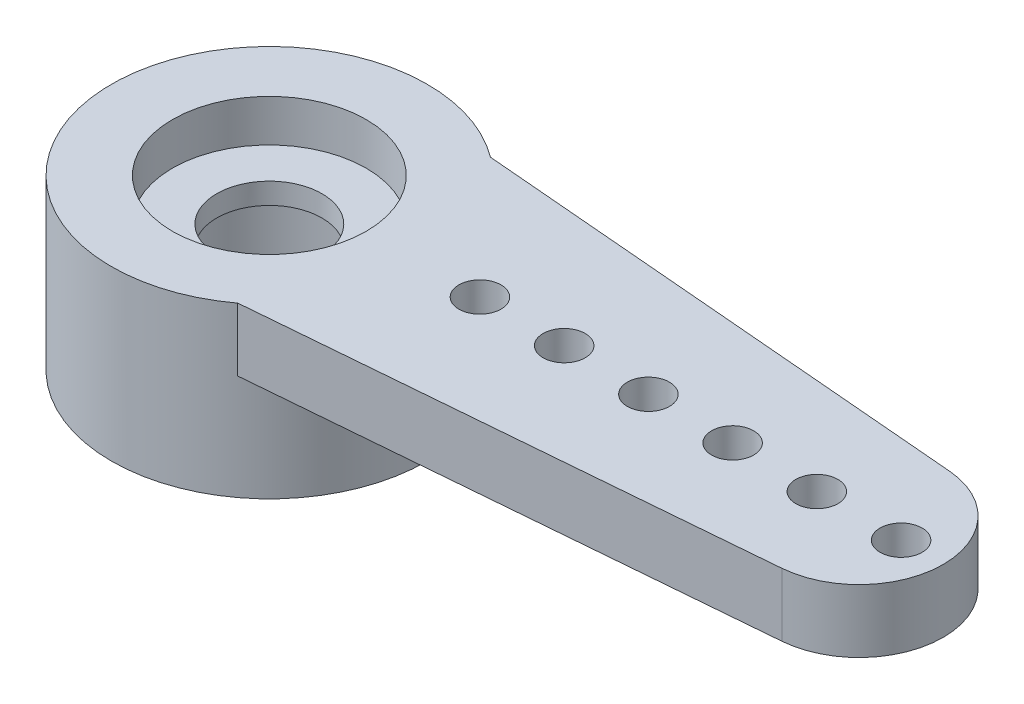
ISO-10303-21;
HEADER;
FILE_DESCRIPTION(('STEP AP214'),'2;1');
FILE_NAME('part.step','',(''),(''),'','','');
FILE_SCHEMA(('AUTOMOTIVE_DESIGN { 1 0 10303 214 1 1 1 1 }'));
ENDSEC;
DATA;
#1=APPLICATION_CONTEXT('core data for automotive mechanical design processes');
#2=APPLICATION_PROTOCOL_DEFINITION('international standard','automotive_design',2000,#1);
#3=PRODUCT_CONTEXT('',#1,'mechanical');
#4=PRODUCT('Part','Part','',(#3));
#5=PRODUCT_RELATED_PRODUCT_CATEGORY('part','',(#4));
#6=PRODUCT_DEFINITION_FORMATION('','',#4);
#7=PRODUCT_DEFINITION_CONTEXT('part definition',#1,'design');
#8=PRODUCT_DEFINITION('design','',#6,#7);
#9=PRODUCT_DEFINITION_SHAPE('','',#8);
#10=(LENGTH_UNIT() NAMED_UNIT(*) SI_UNIT(.MILLI.,.METRE.));
#11=(NAMED_UNIT(*) PLANE_ANGLE_UNIT() SI_UNIT($,.RADIAN.));
#12=(NAMED_UNIT(*) SI_UNIT($,.STERADIAN.) SOLID_ANGLE_UNIT());
#13=UNCERTAINTY_MEASURE_WITH_UNIT(LENGTH_MEASURE(1.E-05),#10,'distance_accuracy_value','');
#14=(GEOMETRIC_REPRESENTATION_CONTEXT(3) GLOBAL_UNCERTAINTY_ASSIGNED_CONTEXT((#13)) GLOBAL_UNIT_ASSIGNED_CONTEXT((#10,
#11,#12)) REPRESENTATION_CONTEXT('',''));
#15=CARTESIAN_POINT('',(0.,0.,0.));
#16=DIRECTION('',(0.,0.,1.));
#17=DIRECTION('',(1.,0.,0.));
#18=AXIS2_PLACEMENT_3D('',#15,#16,#17);
#19=CARTESIAN_POINT('',(0.,-1.5,0.));
#20=DIRECTION('',(0.,1.,0.));
#21=DIRECTION('',(0.,0.,1.));
#22=AXIS2_PLACEMENT_3D('',#19,#20,#21);
#23=CYLINDRICAL_SURFACE('',#22,1.25);
#24=CARTESIAN_POINT('',(0.,3.,0.));
#25=DIRECTION('',(0.,1.,0.));
#26=DIRECTION('',(0.,0.,1.));
#27=AXIS2_PLACEMENT_3D('',#24,#25,#26);
#28=CIRCLE('',#27,1.25);
#29=CARTESIAN_POINT('',(0.,3.,1.25));
#30=VERTEX_POINT('',#29);
#31=EDGE_CURVE('E189',#30,#30,#28,.T.);
#32=ORIENTED_EDGE('',*,*,#31,.T.);
#33=EDGE_LOOP('',(#32));
#34=FACE_BOUND('',#33,.T.);
#35=CARTESIAN_POINT('',(0.,2.5,0.));
#36=DIRECTION('',(0.,-1.,0.));
#37=DIRECTION('',(0.,0.,-1.));
#38=AXIS2_PLACEMENT_3D('',#35,#36,#37);
#39=CIRCLE('',#38,1.25);
#40=CARTESIAN_POINT('',(0.,2.5,-1.25));
#41=VERTEX_POINT('',#40);
#42=EDGE_CURVE('E37',#41,#41,#39,.F.);
#43=ORIENTED_EDGE('',*,*,#42,.F.);
#44=EDGE_LOOP('',(#43));
#45=FACE_BOUND('',#44,.T.);
#46=ADVANCED_FACE('F33',(#34,#45),#23,.F.);
#47=CARTESIAN_POINT('',(0.,4.,0.));
#48=DIRECTION('',(0.,-1.,0.));
#49=DIRECTION('',(0.,0.,-1.));
#50=AXIS2_PLACEMENT_3D('',#47,#48,#49);
#51=CYLINDRICAL_SURFACE('',#50,3.75);
#52=CARTESIAN_POINT('',(0.,4.,0.));
#53=DIRECTION('',(0.,1.,0.));
#54=DIRECTION('',(0.,0.,1.));
#55=AXIS2_PLACEMENT_3D('',#52,#53,#54);
#56=CIRCLE('',#55,3.75);
#57=CARTESIAN_POINT('',(2.25,4.,-3.));
#58=VERTEX_POINT('',#57);
#59=CARTESIAN_POINT('',(2.25,4.,3.));
#60=VERTEX_POINT('',#59);
#61=EDGE_CURVE('E11',#58,#60,#56,.T.);
#62=ORIENTED_EDGE('',*,*,#61,.F.);
#63=DIRECTION('',(0.,1.,0.));
#64=VECTOR('',#63,1.);
#65=CARTESIAN_POINT('',(2.25,2.5,-3.));
#66=LINE('',#65,#64);
#67=CARTESIAN_POINT('',(2.25,2.5,-3.));
#68=VERTEX_POINT('',#67);
#69=EDGE_CURVE('E106',#68,#58,#66,.T.);
#70=ORIENTED_EDGE('',*,*,#69,.F.);
#71=CARTESIAN_POINT('',(0.,2.5,0.));
#72=DIRECTION('',(0.,-1.,0.));
#73=DIRECTION('',(0.,0.,-1.));
#74=AXIS2_PLACEMENT_3D('',#71,#72,#73);
#75=CIRCLE('',#74,3.75);
#76=CARTESIAN_POINT('',(2.25,2.5,3.));
#77=VERTEX_POINT('',#76);
#78=EDGE_CURVE('E58',#68,#77,#75,.T.);
#79=ORIENTED_EDGE('',*,*,#78,.T.);
#80=DIRECTION('',(0.,1.,0.));
#81=VECTOR('',#80,1.);
#82=CARTESIAN_POINT('',(2.25,2.5,3.));
#83=LINE('',#82,#81);
#84=EDGE_CURVE('E82',#77,#60,#83,.T.);
#85=ORIENTED_EDGE('',*,*,#84,.T.);
#86=EDGE_LOOP('',(#62,#70,#79,#85));
#87=FACE_BOUND('',#86,.T.);
#88=CARTESIAN_POINT('',(0.,0.,0.));
#89=DIRECTION('',(0.,1.,0.));
#90=DIRECTION('',(0.,0.,1.));
#91=AXIS2_PLACEMENT_3D('',#88,#89,#90);
#92=CIRCLE('',#91,3.75);
#93=CARTESIAN_POINT('',(0.,0.,3.75));
#94=VERTEX_POINT('',#93);
#95=EDGE_CURVE('E42',#94,#94,#92,.T.);
#96=ORIENTED_EDGE('',*,*,#95,.T.);
#97=EDGE_LOOP('',(#96));
#98=FACE_BOUND('',#97,.T.);
#99=ADVANCED_FACE('F35',(#87,#98),#51,.T.);
#100=CARTESIAN_POINT('',(0.,4.,0.));
#101=DIRECTION('',(0.,1.,0.));
#102=DIRECTION('',(0.,0.,1.));
#103=AXIS2_PLACEMENT_3D('',#100,#101,#102);
#104=PLANE('',#103);
#105=CARTESIAN_POINT('',(0.,4.,0.));
#106=DIRECTION('',(0.,1.,0.));
#107=DIRECTION('',(0.,0.,1.));
#108=AXIS2_PLACEMENT_3D('',#105,#106,#107);
#109=CIRCLE('',#108,2.3);
#110=CARTESIAN_POINT('',(0.,4.,2.3));
#111=VERTEX_POINT('',#110);
#112=EDGE_CURVE('E108',#111,#111,#109,.T.);
#113=ORIENTED_EDGE('',*,*,#112,.F.);
#114=EDGE_LOOP('',(#113));
#115=FACE_BOUND('',#114,.T.);
#116=ORIENTED_EDGE('',*,*,#61,.T.);
#117=DIRECTION('',(0.996448898518601,0.,-0.0841997187707063));
#118=VECTOR('',#117,1.);
#119=CARTESIAN_POINT('',(14.1683994375414,4.,1.9928977970372));
#120=LINE('',#119,#118);
#121=CARTESIAN_POINT('',(14.1683994375414,4.,1.99289779703721));
#122=VERTEX_POINT('',#121);
#123=EDGE_CURVE('E101',#60,#122,#120,.T.);
#124=ORIENTED_EDGE('',*,*,#123,.T.);
#125=CARTESIAN_POINT('',(14.,4.,0.));
#126=DIRECTION('',(0.,1.,0.));
#127=DIRECTION('',(0.,0.,-1.));
#128=AXIS2_PLACEMENT_3D('',#125,#126,#127);
#129=CIRCLE('',#128,2.);
#130=CARTESIAN_POINT('',(14.1683994375414,4.,-1.9928977970372));
#131=VERTEX_POINT('',#130);
#132=EDGE_CURVE('E88',#122,#131,#129,.T.);
#133=ORIENTED_EDGE('',*,*,#132,.T.);
#134=DIRECTION('',(-0.996448898518601,0.,-0.0841997187707069));
#135=VECTOR('',#134,1.);
#136=CARTESIAN_POINT('',(14.1683994375414,4.,-1.9928977970372));
#137=LINE('',#136,#135);
#138=EDGE_CURVE('E49',#131,#58,#137,.T.);
#139=ORIENTED_EDGE('',*,*,#138,.T.);
#140=EDGE_LOOP('',(#116,#124,#133,#139));
#141=FACE_BOUND('',#140,.T.);
#142=CARTESIAN_POINT('',(13.,4.,0.));
#143=DIRECTION('',(0.,1.,0.));
#144=DIRECTION('',(0.,0.,-1.));
#145=AXIS2_PLACEMENT_3D('',#142,#143,#144);
#146=CIRCLE('',#145,0.500000000000001);
#147=CARTESIAN_POINT('',(13.,4.,-0.499999999999997));
#148=VERTEX_POINT('',#147);
#149=EDGE_CURVE('E198',#148,#148,#146,.T.);
#150=ORIENTED_EDGE('',*,*,#149,.F.);
#151=EDGE_LOOP('',(#150));
#152=FACE_BOUND('',#151,.T.);
#153=CARTESIAN_POINT('',(11.,4.,0.));
#154=DIRECTION('',(0.,1.,0.));
#155=DIRECTION('',(0.,0.,-1.));
#156=AXIS2_PLACEMENT_3D('',#153,#154,#155);
#157=CIRCLE('',#156,0.500000000000001);
#158=CARTESIAN_POINT('',(11.,4.,-0.499999999999997));
#159=VERTEX_POINT('',#158);
#160=EDGE_CURVE('E202',#159,#159,#157,.T.);
#161=ORIENTED_EDGE('',*,*,#160,.F.);
#162=EDGE_LOOP('',(#161));
#163=FACE_BOUND('',#162,.T.);
#164=CARTESIAN_POINT('',(9.,4.,0.));
#165=DIRECTION('',(0.,1.,0.));
#166=DIRECTION('',(0.,0.,-1.));
#167=AXIS2_PLACEMENT_3D('',#164,#165,#166);
#168=CIRCLE('',#167,0.500000000000001);
#169=CARTESIAN_POINT('',(9.,4.,-0.499999999999997));
#170=VERTEX_POINT('',#169);
#171=EDGE_CURVE('E206',#170,#170,#168,.T.);
#172=ORIENTED_EDGE('',*,*,#171,.F.);
#173=EDGE_LOOP('',(#172));
#174=FACE_BOUND('',#173,.T.);
#175=CARTESIAN_POINT('',(7.,4.,0.));
#176=DIRECTION('',(0.,1.,0.));
#177=DIRECTION('',(0.,0.,-1.));
#178=AXIS2_PLACEMENT_3D('',#175,#176,#177);
#179=CIRCLE('',#178,0.500000000000001);
#180=CARTESIAN_POINT('',(7.,4.,-0.499999999999997));
#181=VERTEX_POINT('',#180);
#182=EDGE_CURVE('E210',#181,#181,#179,.T.);
#183=ORIENTED_EDGE('',*,*,#182,.F.);
#184=EDGE_LOOP('',(#183));
#185=FACE_BOUND('',#184,.T.);
#186=CARTESIAN_POINT('',(5.,4.,0.));
#187=DIRECTION('',(0.,1.,0.));
#188=DIRECTION('',(0.,0.,-1.));
#189=AXIS2_PLACEMENT_3D('',#186,#187,#188);
#190=CIRCLE('',#189,0.500000000000001);
#191=CARTESIAN_POINT('',(5.,4.,-0.499999999999997));
#192=VERTEX_POINT('',#191);
#193=EDGE_CURVE('E214',#192,#192,#190,.T.);
#194=ORIENTED_EDGE('',*,*,#193,.F.);
#195=EDGE_LOOP('',(#194));
#196=FACE_BOUND('',#195,.T.);
#197=CARTESIAN_POINT('',(15.,4.,0.));
#198=DIRECTION('',(0.,1.,0.));
#199=DIRECTION('',(0.,0.,-1.));
#200=AXIS2_PLACEMENT_3D('',#197,#198,#199);
#201=CIRCLE('',#200,0.500000000000001);
#202=CARTESIAN_POINT('',(15.,4.,-0.499999999999997));
#203=VERTEX_POINT('',#202);
#204=EDGE_CURVE('E217',#203,#203,#201,.T.);
#205=ORIENTED_EDGE('',*,*,#204,.F.);
#206=EDGE_LOOP('',(#205));
#207=FACE_BOUND('',#206,.T.);
#208=ADVANCED_FACE('F122',(#115,#141,#152,#163,#174,#185,#196,#207),#104,.T.);
#209=CARTESIAN_POINT('',(0.,0.,0.));
#210=DIRECTION('',(0.,1.,0.));
#211=DIRECTION('',(0.,0.,1.));
#212=AXIS2_PLACEMENT_3D('',#209,#210,#211);
#213=PLANE('',#212);
#214=CARTESIAN_POINT('',(0.,0.,0.));
#215=DIRECTION('',(0.,-1.,0.));
#216=DIRECTION('',(0.,0.,-1.));
#217=AXIS2_PLACEMENT_3D('',#214,#215,#216);
#218=CIRCLE('',#217,2.3);
#219=CARTESIAN_POINT('',(0.,0.,-2.3));
#220=VERTEX_POINT('',#219);
#221=EDGE_CURVE('E243',#220,#220,#218,.T.);
#222=ORIENTED_EDGE('',*,*,#221,.F.);
#223=EDGE_LOOP('',(#222));
#224=FACE_BOUND('',#223,.T.);
#225=ORIENTED_EDGE('',*,*,#95,.F.);
#226=EDGE_LOOP('',(#225));
#227=FACE_BOUND('',#226,.T.);
#228=ADVANCED_FACE('F119',(#224,#227),#213,.F.);
#229=CARTESIAN_POINT('',(0.,3.,0.));
#230=DIRECTION('',(0.,1.,0.));
#231=DIRECTION('',(0.,0.,1.));
#232=AXIS2_PLACEMENT_3D('',#229,#230,#231);
#233=CYLINDRICAL_SURFACE('',#232,2.3);
#234=CARTESIAN_POINT('',(0.,3.,0.));
#235=DIRECTION('',(0.,1.,0.));
#236=DIRECTION('',(0.,0.,1.));
#237=AXIS2_PLACEMENT_3D('',#234,#235,#236);
#238=CIRCLE('',#237,2.3);
#239=CARTESIAN_POINT('',(0.,3.,2.3));
#240=VERTEX_POINT('',#239);
#241=EDGE_CURVE('E111',#240,#240,#238,.T.);
#242=ORIENTED_EDGE('',*,*,#241,.F.);
#243=EDGE_LOOP('',(#242));
#244=FACE_BOUND('',#243,.T.);
#245=ORIENTED_EDGE('',*,*,#112,.T.);
#246=EDGE_LOOP('',(#245));
#247=FACE_BOUND('',#246,.T.);
#248=ADVANCED_FACE('F121',(#244,#247),#233,.F.);
#249=CARTESIAN_POINT('',(0.,3.,0.));
#250=DIRECTION('',(0.,1.,0.));
#251=DIRECTION('',(0.,0.,1.));
#252=AXIS2_PLACEMENT_3D('',#249,#250,#251);
#253=PLANE('',#252);
#254=ORIENTED_EDGE('',*,*,#31,.F.);
#255=EDGE_LOOP('',(#254));
#256=FACE_BOUND('',#255,.T.);
#257=ORIENTED_EDGE('',*,*,#241,.T.);
#258=EDGE_LOOP('',(#257));
#259=FACE_BOUND('',#258,.T.);
#260=ADVANCED_FACE('F128',(#256,#259),#253,.T.);
#261=CARTESIAN_POINT('',(14.1683994375414,2.5,-1.9928977970372));
#262=DIRECTION('',(0.0841997187707069,0.,-0.996448898518601));
#263=DIRECTION('',(-0.996448898518601,0.,-0.0841997187707069));
#264=AXIS2_PLACEMENT_3D('',#261,#262,#263);
#265=PLANE('',#264);
#266=ORIENTED_EDGE('',*,*,#138,.F.);
#267=DIRECTION('',(0.,1.,0.));
#268=VECTOR('',#267,1.);
#269=CARTESIAN_POINT('',(14.1683994375414,2.5,-1.9928977970372));
#270=LINE('',#269,#268);
#271=CARTESIAN_POINT('',(14.1683994375414,2.5,-1.9928977970372));
#272=VERTEX_POINT('',#271);
#273=EDGE_CURVE('E76',#272,#131,#270,.T.);
#274=ORIENTED_EDGE('',*,*,#273,.F.);
#275=DIRECTION('',(-0.996448898518601,0.,-0.0841997187707069));
#276=VECTOR('',#275,1.);
#277=CARTESIAN_POINT('',(14.1683994375414,2.5,-1.9928977970372));
#278=LINE('',#277,#276);
#279=EDGE_CURVE('E93',#272,#68,#278,.T.);
#280=ORIENTED_EDGE('',*,*,#279,.T.);
#281=ORIENTED_EDGE('',*,*,#69,.T.);
#282=EDGE_LOOP('',(#266,#274,#280,#281));
#283=FACE_BOUND('',#282,.T.);
#284=ADVANCED_FACE('F175',(#283),#265,.T.);
#285=CARTESIAN_POINT('',(14.,2.5,0.));
#286=DIRECTION('',(0.,1.,0.));
#287=DIRECTION('',(0.,0.,1.));
#288=AXIS2_PLACEMENT_3D('',#285,#286,#287);
#289=CYLINDRICAL_SURFACE('',#288,2.);
#290=ORIENTED_EDGE('',*,*,#132,.F.);
#291=DIRECTION('',(0.,1.,0.));
#292=VECTOR('',#291,1.);
#293=CARTESIAN_POINT('',(14.1683994375414,2.5,1.99289779703721));
#294=LINE('',#293,#292);
#295=CARTESIAN_POINT('',(14.1683994375414,2.5,1.99289779703721));
#296=VERTEX_POINT('',#295);
#297=EDGE_CURVE('E84',#296,#122,#294,.T.);
#298=ORIENTED_EDGE('',*,*,#297,.F.);
#299=CARTESIAN_POINT('',(14.,2.5,0.));
#300=DIRECTION('',(0.,1.,0.));
#301=DIRECTION('',(0.,0.,-1.));
#302=AXIS2_PLACEMENT_3D('',#299,#300,#301);
#303=CIRCLE('',#302,2.);
#304=EDGE_CURVE('E87',#296,#272,#303,.T.);
#305=ORIENTED_EDGE('',*,*,#304,.T.);
#306=ORIENTED_EDGE('',*,*,#273,.T.);
#307=EDGE_LOOP('',(#290,#298,#305,#306));
#308=FACE_BOUND('',#307,.T.);
#309=ADVANCED_FACE('F86',(#308),#289,.T.);
#310=CARTESIAN_POINT('',(14.1683994375414,2.5,1.9928977970372));
#311=DIRECTION('',(0.0841997187707063,0.,0.996448898518601));
#312=DIRECTION('',(0.996448898518601,0.,-0.0841997187707063));
#313=AXIS2_PLACEMENT_3D('',#310,#311,#312);
#314=PLANE('',#313);
#315=ORIENTED_EDGE('',*,*,#123,.F.);
#316=ORIENTED_EDGE('',*,*,#84,.F.);
#317=DIRECTION('',(0.996448898518601,0.,-0.0841997187707063));
#318=VECTOR('',#317,1.);
#319=CARTESIAN_POINT('',(14.1683994375414,2.5,1.9928977970372));
#320=LINE('',#319,#318);
#321=EDGE_CURVE('E92',#77,#296,#320,.T.);
#322=ORIENTED_EDGE('',*,*,#321,.T.);
#323=ORIENTED_EDGE('',*,*,#297,.T.);
#324=EDGE_LOOP('',(#315,#316,#322,#323));
#325=FACE_BOUND('',#324,.T.);
#326=ADVANCED_FACE('F95',(#325),#314,.T.);
#327=CARTESIAN_POINT('',(0.,2.5,0.));
#328=DIRECTION('',(0.,-1.,0.));
#329=DIRECTION('',(0.,0.,-1.));
#330=AXIS2_PLACEMENT_3D('',#327,#328,#329);
#331=PLANE('',#330);
#332=CARTESIAN_POINT('',(13.,2.5,0.));
#333=DIRECTION('',(0.,1.,0.));
#334=DIRECTION('',(0.,0.,-1.));
#335=AXIS2_PLACEMENT_3D('',#332,#333,#334);
#336=CIRCLE('',#335,0.500000000000001);
#337=CARTESIAN_POINT('',(13.,2.5,-0.499999999999997));
#338=VERTEX_POINT('',#337);
#339=EDGE_CURVE('E236',#338,#338,#336,.T.);
#340=ORIENTED_EDGE('',*,*,#339,.T.);
#341=EDGE_LOOP('',(#340));
#342=FACE_BOUND('',#341,.T.);
#343=CARTESIAN_POINT('',(11.,2.5,0.));
#344=DIRECTION('',(0.,1.,0.));
#345=DIRECTION('',(0.,0.,-1.));
#346=AXIS2_PLACEMENT_3D('',#343,#344,#345);
#347=CIRCLE('',#346,0.500000000000001);
#348=CARTESIAN_POINT('',(11.,2.5,-0.499999999999997));
#349=VERTEX_POINT('',#348);
#350=EDGE_CURVE('E232',#349,#349,#347,.T.);
#351=ORIENTED_EDGE('',*,*,#350,.T.);
#352=EDGE_LOOP('',(#351));
#353=FACE_BOUND('',#352,.T.);
#354=CARTESIAN_POINT('',(9.,2.5,0.));
#355=DIRECTION('',(0.,1.,0.));
#356=DIRECTION('',(0.,0.,-1.));
#357=AXIS2_PLACEMENT_3D('',#354,#355,#356);
#358=CIRCLE('',#357,0.500000000000001);
#359=CARTESIAN_POINT('',(9.,2.5,-0.499999999999997));
#360=VERTEX_POINT('',#359);
#361=EDGE_CURVE('E228',#360,#360,#358,.T.);
#362=ORIENTED_EDGE('',*,*,#361,.T.);
#363=EDGE_LOOP('',(#362));
#364=FACE_BOUND('',#363,.T.);
#365=CARTESIAN_POINT('',(7.,2.5,0.));
#366=DIRECTION('',(0.,1.,0.));
#367=DIRECTION('',(0.,0.,-1.));
#368=AXIS2_PLACEMENT_3D('',#365,#366,#367);
#369=CIRCLE('',#368,0.500000000000001);
#370=CARTESIAN_POINT('',(7.,2.5,-0.499999999999997));
#371=VERTEX_POINT('',#370);
#372=EDGE_CURVE('E225',#371,#371,#369,.T.);
#373=ORIENTED_EDGE('',*,*,#372,.T.);
#374=EDGE_LOOP('',(#373));
#375=FACE_BOUND('',#374,.T.);
#376=CARTESIAN_POINT('',(5.,2.5,0.));
#377=DIRECTION('',(0.,1.,0.));
#378=DIRECTION('',(0.,0.,-1.));
#379=AXIS2_PLACEMENT_3D('',#376,#377,#378);
#380=CIRCLE('',#379,0.500000000000001);
#381=CARTESIAN_POINT('',(5.,2.5,-0.499999999999997));
#382=VERTEX_POINT('',#381);
#383=EDGE_CURVE('E219',#382,#382,#380,.T.);
#384=ORIENTED_EDGE('',*,*,#383,.T.);
#385=EDGE_LOOP('',(#384));
#386=FACE_BOUND('',#385,.T.);
#387=CARTESIAN_POINT('',(15.,2.5,0.));
#388=DIRECTION('',(0.,1.,0.));
#389=DIRECTION('',(0.,0.,-1.));
#390=AXIS2_PLACEMENT_3D('',#387,#388,#389);
#391=CIRCLE('',#390,0.500000000000001);
#392=CARTESIAN_POINT('',(15.,2.5,-0.499999999999997));
#393=VERTEX_POINT('',#392);
#394=EDGE_CURVE('E103',#393,#393,#391,.T.);
#395=ORIENTED_EDGE('',*,*,#394,.T.);
#396=EDGE_LOOP('',(#395));
#397=FACE_BOUND('',#396,.T.);
#398=ORIENTED_EDGE('',*,*,#78,.F.);
#399=ORIENTED_EDGE('',*,*,#279,.F.);
#400=ORIENTED_EDGE('',*,*,#304,.F.);
#401=ORIENTED_EDGE('',*,*,#321,.F.);
#402=EDGE_LOOP('',(#398,#399,#400,#401));
#403=FACE_BOUND('',#402,.T.);
#404=ADVANCED_FACE('F91',(#342,#353,#364,#375,#386,#397,#403),#331,.T.);
#405=CARTESIAN_POINT('',(15.,2.5,0.));
#406=DIRECTION('',(0.,1.,0.));
#407=DIRECTION('',(0.,0.,1.));
#408=AXIS2_PLACEMENT_3D('',#405,#406,#407);
#409=CYLINDRICAL_SURFACE('',#408,0.500000000000001);
#410=ORIENTED_EDGE('',*,*,#394,.F.);
#411=EDGE_LOOP('',(#410));
#412=FACE_BOUND('',#411,.T.);
#413=ORIENTED_EDGE('',*,*,#204,.T.);
#414=EDGE_LOOP('',(#413));
#415=FACE_BOUND('',#414,.T.);
#416=ADVANCED_FACE('F167',(#412,#415),#409,.F.);
#417=CARTESIAN_POINT('',(5.,2.5,0.));
#418=DIRECTION('',(0.,1.,0.));
#419=DIRECTION('',(0.,0.,1.));
#420=AXIS2_PLACEMENT_3D('',#417,#418,#419);
#421=CYLINDRICAL_SURFACE('',#420,0.500000000000001);
#422=ORIENTED_EDGE('',*,*,#383,.F.);
#423=EDGE_LOOP('',(#422));
#424=FACE_BOUND('',#423,.T.);
#425=ORIENTED_EDGE('',*,*,#193,.T.);
#426=EDGE_LOOP('',(#425));
#427=FACE_BOUND('',#426,.T.);
#428=ADVANCED_FACE('F163',(#424,#427),#421,.F.);
#429=CARTESIAN_POINT('',(7.,2.5,0.));
#430=DIRECTION('',(0.,1.,0.));
#431=DIRECTION('',(0.,0.,1.));
#432=AXIS2_PLACEMENT_3D('',#429,#430,#431);
#433=CYLINDRICAL_SURFACE('',#432,0.500000000000001);
#434=ORIENTED_EDGE('',*,*,#372,.F.);
#435=EDGE_LOOP('',(#434));
#436=FACE_BOUND('',#435,.T.);
#437=ORIENTED_EDGE('',*,*,#182,.T.);
#438=EDGE_LOOP('',(#437));
#439=FACE_BOUND('',#438,.T.);
#440=ADVANCED_FACE('F159',(#436,#439),#433,.F.);
#441=CARTESIAN_POINT('',(9.,2.5,0.));
#442=DIRECTION('',(0.,1.,0.));
#443=DIRECTION('',(0.,0.,1.));
#444=AXIS2_PLACEMENT_3D('',#441,#442,#443);
#445=CYLINDRICAL_SURFACE('',#444,0.500000000000001);
#446=ORIENTED_EDGE('',*,*,#361,.F.);
#447=EDGE_LOOP('',(#446));
#448=FACE_BOUND('',#447,.T.);
#449=ORIENTED_EDGE('',*,*,#171,.T.);
#450=EDGE_LOOP('',(#449));
#451=FACE_BOUND('',#450,.T.);
#452=ADVANCED_FACE('F155',(#448,#451),#445,.F.);
#453=CARTESIAN_POINT('',(11.,2.5,0.));
#454=DIRECTION('',(0.,1.,0.));
#455=DIRECTION('',(0.,0.,1.));
#456=AXIS2_PLACEMENT_3D('',#453,#454,#455);
#457=CYLINDRICAL_SURFACE('',#456,0.500000000000001);
#458=ORIENTED_EDGE('',*,*,#350,.F.);
#459=EDGE_LOOP('',(#458));
#460=FACE_BOUND('',#459,.T.);
#461=ORIENTED_EDGE('',*,*,#160,.T.);
#462=EDGE_LOOP('',(#461));
#463=FACE_BOUND('',#462,.T.);
#464=ADVANCED_FACE('F151',(#460,#463),#457,.F.);
#465=CARTESIAN_POINT('',(13.,2.5,0.));
#466=DIRECTION('',(0.,1.,0.));
#467=DIRECTION('',(0.,0.,1.));
#468=AXIS2_PLACEMENT_3D('',#465,#466,#467);
#469=CYLINDRICAL_SURFACE('',#468,0.500000000000001);
#470=ORIENTED_EDGE('',*,*,#339,.F.);
#471=EDGE_LOOP('',(#470));
#472=FACE_BOUND('',#471,.T.);
#473=ORIENTED_EDGE('',*,*,#149,.T.);
#474=EDGE_LOOP('',(#473));
#475=FACE_BOUND('',#474,.T.);
#476=ADVANCED_FACE('F147',(#472,#475),#469,.F.);
#477=CARTESIAN_POINT('',(0.,2.5,0.));
#478=DIRECTION('',(0.,-1.,0.));
#479=DIRECTION('',(0.,0.,-1.));
#480=AXIS2_PLACEMENT_3D('',#477,#478,#479);
#481=PLANE('',#480);
#482=CARTESIAN_POINT('',(0.,2.5,0.));
#483=DIRECTION('',(0.,-1.,0.));
#484=DIRECTION('',(0.,0.,-1.));
#485=AXIS2_PLACEMENT_3D('',#482,#483,#484);
#486=CIRCLE('',#485,2.3);
#487=CARTESIAN_POINT('',(0.,2.5,-2.3));
#488=VERTEX_POINT('',#487);
#489=EDGE_CURVE('E246',#488,#488,#486,.T.);
#490=ORIENTED_EDGE('',*,*,#489,.T.);
#491=EDGE_LOOP('',(#490));
#492=FACE_BOUND('',#491,.T.);
#493=ORIENTED_EDGE('',*,*,#42,.T.);
#494=EDGE_LOOP('',(#493));
#495=FACE_BOUND('',#494,.T.);
#496=ADVANCED_FACE('F150',(#492,#495),#481,.T.);
#497=CARTESIAN_POINT('',(0.,2.5,0.));
#498=DIRECTION('',(0.,-1.,0.));
#499=DIRECTION('',(0.,0.,-1.));
#500=AXIS2_PLACEMENT_3D('',#497,#498,#499);
#501=CYLINDRICAL_SURFACE('',#500,2.3);
#502=ORIENTED_EDGE('',*,*,#489,.F.);
#503=EDGE_LOOP('',(#502));
#504=FACE_BOUND('',#503,.T.);
#505=ORIENTED_EDGE('',*,*,#221,.T.);
#506=EDGE_LOOP('',(#505));
#507=FACE_BOUND('',#506,.T.);
#508=ADVANCED_FACE('F145',(#504,#507),#501,.F.);
#509=CLOSED_SHELL('',(#46,#99,#208,#228,#248,#260,#284,#309,#326,#404,#416,#428,#440,#452,#464,
#476,#496,#508));
#510=MANIFOLD_SOLID_BREP('B2',#509);
#511=ADVANCED_BREP_SHAPE_REPRESENTATION('',(#18,#510),#14);
#512=SHAPE_DEFINITION_REPRESENTATION(#9,#511);
ENDSEC;
END-ISO-10303-21;
